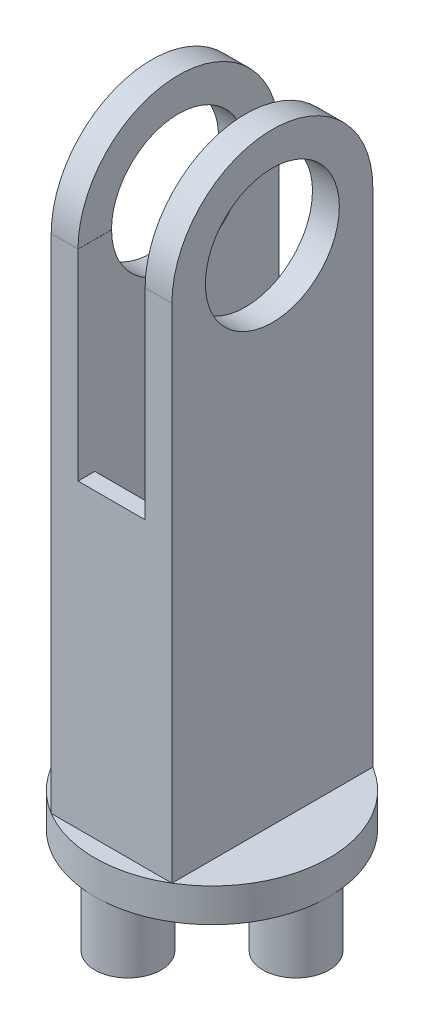
ISO-10303-21;
HEADER;
FILE_DESCRIPTION(('STEP AP214'),'2;1');
FILE_NAME('part.step','',(''),(''),'','','');
FILE_SCHEMA(('AUTOMOTIVE_DESIGN { 1 0 10303 214 1 1 1 1 }'));
ENDSEC;
DATA;
#1=APPLICATION_CONTEXT('core data for automotive mechanical design processes');
#2=APPLICATION_PROTOCOL_DEFINITION('international standard','automotive_design',2000,#1);
#3=PRODUCT_CONTEXT('',#1,'mechanical');
#4=PRODUCT('Part','Part','',(#3));
#5=PRODUCT_RELATED_PRODUCT_CATEGORY('part','',(#4));
#6=PRODUCT_DEFINITION_FORMATION('','',#4);
#7=PRODUCT_DEFINITION_CONTEXT('part definition',#1,'design');
#8=PRODUCT_DEFINITION('design','',#6,#7);
#9=PRODUCT_DEFINITION_SHAPE('','',#8);
#10=(LENGTH_UNIT() NAMED_UNIT(*) SI_UNIT(.MILLI.,.METRE.));
#11=(NAMED_UNIT(*) PLANE_ANGLE_UNIT() SI_UNIT($,.RADIAN.));
#12=(NAMED_UNIT(*) SI_UNIT($,.STERADIAN.) SOLID_ANGLE_UNIT());
#13=UNCERTAINTY_MEASURE_WITH_UNIT(LENGTH_MEASURE(1.E-05),#10,'distance_accuracy_value','');
#14=(GEOMETRIC_REPRESENTATION_CONTEXT(3) GLOBAL_UNCERTAINTY_ASSIGNED_CONTEXT((#13)) GLOBAL_UNIT_ASSIGNED_CONTEXT((#10,
#11,#12)) REPRESENTATION_CONTEXT('',''));
#15=CARTESIAN_POINT('',(0.,0.,0.));
#16=DIRECTION('',(0.,0.,1.));
#17=DIRECTION('',(1.,0.,0.));
#18=AXIS2_PLACEMENT_3D('',#15,#16,#17);
#19=CARTESIAN_POINT('',(0.,160.,0.));
#20=DIRECTION('',(0.,1.,0.));
#21=DIRECTION('',(0.,0.,1.));
#22=AXIS2_PLACEMENT_3D('',#19,#20,#21);
#23=PLANE('',#22);
#24=DIRECTION('',(1.,0.,0.));
#25=VECTOR('',#24,1.);
#26=CARTESIAN_POINT('',(-78.97224362268,160.,20.));
#27=LINE('',#26,#25);
#28=CARTESIAN_POINT('',(10.,160.,20.));
#29=VERTEX_POINT('',#28);
#30=CARTESIAN_POINT('',(10.02775637732,160.,20.));
#31=VERTEX_POINT('',#30);
#32=EDGE_CURVE('E60',#29,#31,#27,.T.);
#33=ORIENTED_EDGE('',*,*,#32,.F.);
#34=DIRECTION('',(0.,0.,-1.));
#35=VECTOR('',#34,1.);
#36=CARTESIAN_POINT('',(10.,160.,30.));
#37=LINE('',#36,#35);
#38=CARTESIAN_POINT('',(10.,160.,30.));
#39=VERTEX_POINT('',#38);
#40=EDGE_CURVE('E245',#39,#29,#37,.T.);
#41=ORIENTED_EDGE('',*,*,#40,.F.);
#42=DIRECTION('',(1.,0.,0.));
#43=VECTOR('',#42,1.);
#44=CARTESIAN_POINT('',(0.,160.,30.));
#45=LINE('',#44,#43);
#46=CARTESIAN_POINT('',(10.02775637732,160.,30.));
#47=VERTEX_POINT('',#46);
#48=EDGE_CURVE('E268',#39,#47,#45,.T.);
#49=ORIENTED_EDGE('',*,*,#48,.T.);
#50=DIRECTION('',(0.,0.,-1.));
#51=VECTOR('',#50,1.);
#52=CARTESIAN_POINT('',(10.02775637732,160.,0.));
#53=LINE('',#52,#51);
#54=EDGE_CURVE('E191',#47,#31,#53,.T.);
#55=ORIENTED_EDGE('',*,*,#54,.T.);
#56=EDGE_LOOP('',(#33,#41,#49,#55));
#57=FACE_BOUND('',#56,.T.);
#58=ADVANCED_FACE('F37',(#57),#23,.T.);
#59=DIRECTION('',(1.,0.,0.));
#60=VECTOR('',#59,1.);
#61=CARTESIAN_POINT('',(-78.97224362268,160.,20.));
#62=LINE('',#61,#60);
#63=CARTESIAN_POINT('',(-10.02775637732,160.,20.));
#64=VERTEX_POINT('',#63);
#65=CARTESIAN_POINT('',(-10.,160.,20.));
#66=VERTEX_POINT('',#65);
#67=EDGE_CURVE('E338',#64,#66,#62,.T.);
#68=ORIENTED_EDGE('',*,*,#67,.F.);
#69=DIRECTION('',(0.,0.,1.));
#70=VECTOR('',#69,1.);
#71=CARTESIAN_POINT('',(-10.02775637732,160.,0.));
#72=LINE('',#71,#70);
#73=CARTESIAN_POINT('',(-10.02775637732,160.,30.));
#74=VERTEX_POINT('',#73);
#75=EDGE_CURVE('E323',#64,#74,#72,.T.);
#76=ORIENTED_EDGE('',*,*,#75,.T.);
#77=CARTESIAN_POINT('',(-10.,160.,30.));
#78=VERTEX_POINT('',#77);
#79=EDGE_CURVE('E267',#74,#78,#45,.T.);
#80=ORIENTED_EDGE('',*,*,#79,.T.);
#81=DIRECTION('',(0.,0.,1.));
#82=VECTOR('',#81,1.);
#83=CARTESIAN_POINT('',(-10.,160.,30.));
#84=LINE('',#83,#82);
#85=EDGE_CURVE('E248',#66,#78,#84,.T.);
#86=ORIENTED_EDGE('',*,*,#85,.F.);
#87=EDGE_LOOP('',(#68,#76,#80,#86));
#88=FACE_BOUND('',#87,.T.);
#89=ADVANCED_FACE('F335',(#88),#23,.T.);
#90=DIRECTION('',(1.,0.,0.));
#91=VECTOR('',#90,1.);
#92=CARTESIAN_POINT('',(-78.97224362268,160.,-20.));
#93=LINE('',#92,#91);
#94=CARTESIAN_POINT('',(10.02775637732,160.,-20.));
#95=VERTEX_POINT('',#94);
#96=CARTESIAN_POINT('',(10.,160.,-20.));
#97=VERTEX_POINT('',#96);
#98=EDGE_CURVE('E172',#95,#97,#93,.F.);
#99=ORIENTED_EDGE('',*,*,#98,.F.);
#100=CARTESIAN_POINT('',(10.02775637732,160.,-30.));
#101=VERTEX_POINT('',#100);
#102=EDGE_CURVE('E181',#95,#101,#53,.T.);
#103=ORIENTED_EDGE('',*,*,#102,.T.);
#104=DIRECTION('',(1.,0.,0.));
#105=VECTOR('',#104,1.);
#106=CARTESIAN_POINT('',(0.,160.,-30.));
#107=LINE('',#106,#105);
#108=CARTESIAN_POINT('',(10.,160.,-30.));
#109=VERTEX_POINT('',#108);
#110=EDGE_CURVE('E274',#109,#101,#107,.T.);
#111=ORIENTED_EDGE('',*,*,#110,.F.);
#112=EDGE_CURVE('E183',#97,#109,#37,.T.);
#113=ORIENTED_EDGE('',*,*,#112,.F.);
#114=EDGE_LOOP('',(#99,#103,#111,#113));
#115=FACE_BOUND('',#114,.T.);
#116=ADVANCED_FACE('F179',(#115),#23,.T.);
#117=DIRECTION('',(1.,0.,0.));
#118=VECTOR('',#117,1.);
#119=CARTESIAN_POINT('',(-78.97224362268,160.,-20.));
#120=LINE('',#119,#118);
#121=CARTESIAN_POINT('',(-10.,160.,-20.));
#122=VERTEX_POINT('',#121);
#123=CARTESIAN_POINT('',(-10.02775637732,160.,-20.));
#124=VERTEX_POINT('',#123);
#125=EDGE_CURVE('E52',#122,#124,#120,.F.);
#126=ORIENTED_EDGE('',*,*,#125,.F.);
#127=CARTESIAN_POINT('',(-10.,160.,-30.));
#128=VERTEX_POINT('',#127);
#129=EDGE_CURVE('E249',#128,#122,#84,.T.);
#130=ORIENTED_EDGE('',*,*,#129,.F.);
#131=CARTESIAN_POINT('',(-10.02775637732,160.,-30.));
#132=VERTEX_POINT('',#131);
#133=EDGE_CURVE('E273',#132,#128,#107,.T.);
#134=ORIENTED_EDGE('',*,*,#133,.F.);
#135=EDGE_CURVE('E45',#132,#124,#72,.T.);
#136=ORIENTED_EDGE('',*,*,#135,.T.);
#137=EDGE_LOOP('',(#126,#130,#134,#136));
#138=FACE_BOUND('',#137,.T.);
#139=ADVANCED_FACE('F399',(#138),#23,.T.);
#140=CARTESIAN_POINT('',(0.,100.,0.));
#141=DIRECTION('',(0.,-1.,0.));
#142=DIRECTION('',(0.,0.,-1.));
#143=AXIS2_PLACEMENT_3D('',#140,#141,#142);
#144=PLANE('',#143);
#145=DIRECTION('',(0.,0.,-1.));
#146=VECTOR('',#145,1.);
#147=CARTESIAN_POINT('',(10.,100.,30.));
#148=LINE('',#147,#146);
#149=CARTESIAN_POINT('',(10.,100.,30.));
#150=VERTEX_POINT('',#149);
#151=CARTESIAN_POINT('',(10.,100.,25.));
#152=VERTEX_POINT('',#151);
#153=EDGE_CURVE('E230',#150,#152,#148,.T.);
#154=ORIENTED_EDGE('',*,*,#153,.T.);
#155=DIRECTION('',(1.,0.,0.));
#156=VECTOR('',#155,1.);
#157=CARTESIAN_POINT('',(-10.,100.,25.));
#158=LINE('',#157,#156);
#159=CARTESIAN_POINT('',(-10.,100.,25.));
#160=VERTEX_POINT('',#159);
#161=EDGE_CURVE('E209',#160,#152,#158,.T.);
#162=ORIENTED_EDGE('',*,*,#161,.F.);
#163=DIRECTION('',(0.,0.,1.));
#164=VECTOR('',#163,1.);
#165=CARTESIAN_POINT('',(-10.,100.,30.));
#166=LINE('',#165,#164);
#167=CARTESIAN_POINT('',(-10.,100.,30.));
#168=VERTEX_POINT('',#167);
#169=EDGE_CURVE('E237',#160,#168,#166,.T.);
#170=ORIENTED_EDGE('',*,*,#169,.T.);
#171=DIRECTION('',(1.,0.,0.));
#172=VECTOR('',#171,1.);
#173=CARTESIAN_POINT('',(-10.,100.,30.));
#174=LINE('',#173,#172);
#175=EDGE_CURVE('E241',#168,#150,#174,.T.);
#176=ORIENTED_EDGE('',*,*,#175,.T.);
#177=EDGE_LOOP('',(#154,#162,#170,#176));
#178=FACE_BOUND('',#177,.T.);
#179=ADVANCED_FACE('F406',(#178),#144,.F.);
#180=CARTESIAN_POINT('',(0.,10.,0.));
#181=DIRECTION('',(0.,1.,0.));
#182=DIRECTION('',(0.,0.,1.));
#183=AXIS2_PLACEMENT_3D('',#180,#181,#182);
#184=PLANE('',#183);
#185=CARTESIAN_POINT('',(0.,10.,0.));
#186=DIRECTION('',(0.,1.,0.));
#187=DIRECTION('',(0.,0.,1.));
#188=AXIS2_PLACEMENT_3D('',#185,#186,#187);
#189=CIRCLE('',#188,35.);
#190=CARTESIAN_POINT('',(-18.02775637732,10.,-30.));
#191=VERTEX_POINT('',#190);
#192=CARTESIAN_POINT('',(-18.02775637732,10.,30.));
#193=VERTEX_POINT('',#192);
#194=EDGE_CURVE('E467',#191,#193,#189,.T.);
#195=ORIENTED_EDGE('',*,*,#194,.T.);
#196=DIRECTION('',(0.,0.,-1.));
#197=VECTOR('',#196,1.);
#198=CARTESIAN_POINT('',(-18.02775637732,10.,0.));
#199=LINE('',#198,#197);
#200=EDGE_CURVE('E283',#193,#191,#199,.T.);
#201=ORIENTED_EDGE('',*,*,#200,.T.);
#202=EDGE_LOOP('',(#195,#201));
#203=FACE_BOUND('',#202,.T.);
#204=ADVANCED_FACE('F411',(#203),#184,.T.);
#205=CARTESIAN_POINT('',(18.02775637732,10.,-30.));
#206=VERTEX_POINT('',#205);
#207=EDGE_CURVE('E324',#206,#191,#189,.T.);
#208=ORIENTED_EDGE('',*,*,#207,.T.);
#209=DIRECTION('',(1.,0.,0.));
#210=VECTOR('',#209,1.);
#211=CARTESIAN_POINT('',(0.,10.,-30.));
#212=LINE('',#211,#210);
#213=EDGE_CURVE('E280',#191,#206,#212,.T.);
#214=ORIENTED_EDGE('',*,*,#213,.T.);
#215=EDGE_LOOP('',(#208,#214));
#216=FACE_BOUND('',#215,.T.);
#217=ADVANCED_FACE('F471',(#216),#184,.T.);
#218=DIRECTION('',(1.,0.,0.));
#219=VECTOR('',#218,1.);
#220=CARTESIAN_POINT('',(0.,10.,30.));
#221=LINE('',#220,#219);
#222=CARTESIAN_POINT('',(18.02775637732,10.,30.));
#223=VERTEX_POINT('',#222);
#224=EDGE_CURVE('E254',#193,#223,#221,.T.);
#225=ORIENTED_EDGE('',*,*,#224,.F.);
#226=EDGE_CURVE('E325',#193,#223,#189,.T.);
#227=ORIENTED_EDGE('',*,*,#226,.T.);
#228=EDGE_LOOP('',(#225,#227));
#229=FACE_BOUND('',#228,.T.);
#230=ADVANCED_FACE('F460',(#229),#184,.T.);
#231=CARTESIAN_POINT('',(0.,10.,0.));
#232=DIRECTION('',(0.,-1.,0.));
#233=DIRECTION('',(0.,0.,-1.));
#234=AXIS2_PLACEMENT_3D('',#231,#232,#233);
#235=CYLINDRICAL_SURFACE('',#234,35.);
#236=EDGE_CURVE('E321',#223,#206,#189,.T.);
#237=ORIENTED_EDGE('',*,*,#236,.F.);
#238=ORIENTED_EDGE('',*,*,#226,.F.);
#239=ORIENTED_EDGE('',*,*,#194,.F.);
#240=ORIENTED_EDGE('',*,*,#207,.F.);
#241=EDGE_LOOP('',(#237,#238,#239,#240));
#242=FACE_BOUND('',#241,.T.);
#243=CARTESIAN_POINT('',(0.,0.,0.));
#244=DIRECTION('',(0.,1.,0.));
#245=DIRECTION('',(0.,0.,1.));
#246=AXIS2_PLACEMENT_3D('',#243,#244,#245);
#247=CIRCLE('',#246,35.);
#248=CARTESIAN_POINT('',(35.,0.,0.));
#249=VERTEX_POINT('',#248);
#250=CARTESIAN_POINT('',(0.,0.,-35.));
#251=VERTEX_POINT('',#250);
#252=EDGE_CURVE('E326',#249,#251,#247,.T.);
#253=ORIENTED_EDGE('',*,*,#252,.T.);
#254=CARTESIAN_POINT('',(-35.,0.,0.));
#255=VERTEX_POINT('',#254);
#256=EDGE_CURVE('E327',#251,#255,#247,.T.);
#257=ORIENTED_EDGE('',*,*,#256,.T.);
#258=CARTESIAN_POINT('',(0.,0.,35.));
#259=VERTEX_POINT('',#258);
#260=EDGE_CURVE('E497',#255,#259,#247,.T.);
#261=ORIENTED_EDGE('',*,*,#260,.T.);
#262=EDGE_CURVE('E318',#259,#249,#247,.T.);
#263=ORIENTED_EDGE('',*,*,#262,.T.);
#264=EDGE_LOOP('',(#253,#257,#261,#263));
#265=FACE_BOUND('',#264,.T.);
#266=ADVANCED_FACE('F39',(#242,#265),#235,.T.);
#267=DIRECTION('',(0.,0.,-1.));
#268=VECTOR('',#267,1.);
#269=CARTESIAN_POINT('',(18.02775637732,10.,0.));
#270=LINE('',#269,#268);
#271=EDGE_CURVE('E277',#223,#206,#270,.T.);
#272=ORIENTED_EDGE('',*,*,#271,.F.);
#273=ORIENTED_EDGE('',*,*,#236,.T.);
#274=EDGE_LOOP('',(#272,#273));
#275=FACE_BOUND('',#274,.T.);
#276=ADVANCED_FACE('F478',(#275),#184,.T.);
#277=CARTESIAN_POINT('',(0.,0.,0.));
#278=DIRECTION('',(0.,1.,0.));
#279=DIRECTION('',(0.,0.,1.));
#280=AXIS2_PLACEMENT_3D('',#277,#278,#279);
#281=PLANE('',#280);
#282=ORIENTED_EDGE('',*,*,#262,.F.);
#283=CARTESIAN_POINT('',(0.,0.,25.1));
#284=DIRECTION('',(0.,-1.,0.));
#285=DIRECTION('',(0.,0.,-1.));
#286=AXIS2_PLACEMENT_3D('',#283,#284,#285);
#287=CIRCLE('',#286,9.9);
#288=EDGE_CURVE('E297',#259,#259,#287,.T.);
#289=ORIENTED_EDGE('',*,*,#288,.F.);
#290=ORIENTED_EDGE('',*,*,#260,.F.);
#291=CARTESIAN_POINT('',(-25.1,0.,0.));
#292=DIRECTION('',(0.,-1.,0.));
#293=DIRECTION('',(0.,0.,-1.));
#294=AXIS2_PLACEMENT_3D('',#291,#292,#293);
#295=CIRCLE('',#294,9.9);
#296=EDGE_CURVE('E303',#255,#255,#295,.T.);
#297=ORIENTED_EDGE('',*,*,#296,.F.);
#298=ORIENTED_EDGE('',*,*,#256,.F.);
#299=CARTESIAN_POINT('',(0.,0.,-25.1));
#300=DIRECTION('',(0.,-1.,0.));
#301=DIRECTION('',(0.,0.,-1.));
#302=AXIS2_PLACEMENT_3D('',#299,#300,#301);
#303=CIRCLE('',#302,9.9);
#304=EDGE_CURVE('E309',#251,#251,#303,.T.);
#305=ORIENTED_EDGE('',*,*,#304,.F.);
#306=ORIENTED_EDGE('',*,*,#252,.F.);
#307=CARTESIAN_POINT('',(25.1,0.,0.));
#308=DIRECTION('',(0.,-1.,0.));
#309=DIRECTION('',(0.,0.,-1.));
#310=AXIS2_PLACEMENT_3D('',#307,#308,#309);
#311=CIRCLE('',#310,9.9);
#312=EDGE_CURVE('E312',#249,#249,#311,.T.);
#313=ORIENTED_EDGE('',*,*,#312,.F.);
#314=EDGE_LOOP('',(#282,#289,#290,#297,#298,#305,#306,#313));
#315=FACE_BOUND('',#314,.T.);
#316=ADVANCED_FACE('F481',(#315),#281,.F.);
#317=CARTESIAN_POINT('',(25.1,-19.,0.));
#318=DIRECTION('',(0.,1.,0.));
#319=DIRECTION('',(0.,0.,1.));
#320=AXIS2_PLACEMENT_3D('',#317,#318,#319);
#321=CYLINDRICAL_SURFACE('',#320,9.9);
#322=CARTESIAN_POINT('',(25.1,-19.,0.));
#323=DIRECTION('',(0.,-1.,0.));
#324=DIRECTION('',(0.,0.,-1.));
#325=AXIS2_PLACEMENT_3D('',#322,#323,#324);
#326=CIRCLE('',#325,9.9);
#327=CARTESIAN_POINT('',(25.1,-19.,-9.9));
#328=VERTEX_POINT('',#327);
#329=EDGE_CURVE('E315',#328,#328,#326,.T.);
#330=ORIENTED_EDGE('',*,*,#329,.F.);
#331=EDGE_LOOP('',(#330));
#332=FACE_BOUND('',#331,.T.);
#333=ORIENTED_EDGE('',*,*,#312,.T.);
#334=EDGE_LOOP('',(#333));
#335=FACE_BOUND('',#334,.T.);
#336=ADVANCED_FACE('F483',(#332,#335),#321,.T.);
#337=CARTESIAN_POINT('',(25.1,-19.,0.));
#338=DIRECTION('',(0.,-1.,0.));
#339=DIRECTION('',(0.,0.,-1.));
#340=AXIS2_PLACEMENT_3D('',#337,#338,#339);
#341=PLANE('',#340);
#342=ORIENTED_EDGE('',*,*,#329,.T.);
#343=EDGE_LOOP('',(#342));
#344=FACE_BOUND('',#343,.T.);
#345=ADVANCED_FACE('F490',(#344),#341,.T.);
#346=CARTESIAN_POINT('',(0.,-19.,-25.1));
#347=DIRECTION('',(0.,1.,0.));
#348=DIRECTION('',(0.,0.,1.));
#349=AXIS2_PLACEMENT_3D('',#346,#347,#348);
#350=CYLINDRICAL_SURFACE('',#349,9.9);
#351=CARTESIAN_POINT('',(0.,-19.,-25.1));
#352=DIRECTION('',(0.,-1.,0.));
#353=DIRECTION('',(0.,0.,-1.));
#354=AXIS2_PLACEMENT_3D('',#351,#352,#353);
#355=CIRCLE('',#354,9.9);
#356=CARTESIAN_POINT('',(0.,-19.,-35.));
#357=VERTEX_POINT('',#356);
#358=EDGE_CURVE('E306',#357,#357,#355,.T.);
#359=ORIENTED_EDGE('',*,*,#358,.F.);
#360=EDGE_LOOP('',(#359));
#361=FACE_BOUND('',#360,.T.);
#362=ORIENTED_EDGE('',*,*,#304,.T.);
#363=EDGE_LOOP('',(#362));
#364=FACE_BOUND('',#363,.T.);
#365=ADVANCED_FACE('F515',(#361,#364),#350,.T.);
#366=CARTESIAN_POINT('',(0.,-19.,-25.1));
#367=DIRECTION('',(0.,-1.,0.));
#368=DIRECTION('',(0.,0.,-1.));
#369=AXIS2_PLACEMENT_3D('',#366,#367,#368);
#370=PLANE('',#369);
#371=ORIENTED_EDGE('',*,*,#358,.T.);
#372=EDGE_LOOP('',(#371));
#373=FACE_BOUND('',#372,.T.);
#374=ADVANCED_FACE('F505',(#373),#370,.T.);
#375=CARTESIAN_POINT('',(-25.1,-19.,0.));
#376=DIRECTION('',(0.,1.,0.));
#377=DIRECTION('',(0.,0.,1.));
#378=AXIS2_PLACEMENT_3D('',#375,#376,#377);
#379=CYLINDRICAL_SURFACE('',#378,9.9);
#380=CARTESIAN_POINT('',(-25.1,-19.,0.));
#381=DIRECTION('',(0.,-1.,0.));
#382=DIRECTION('',(0.,0.,-1.));
#383=AXIS2_PLACEMENT_3D('',#380,#381,#382);
#384=CIRCLE('',#383,9.9);
#385=CARTESIAN_POINT('',(-25.1,-19.,-9.9));
#386=VERTEX_POINT('',#385);
#387=EDGE_CURVE('E300',#386,#386,#384,.T.);
#388=ORIENTED_EDGE('',*,*,#387,.F.);
#389=EDGE_LOOP('',(#388));
#390=FACE_BOUND('',#389,.T.);
#391=ORIENTED_EDGE('',*,*,#296,.T.);
#392=EDGE_LOOP('',(#391));
#393=FACE_BOUND('',#392,.T.);
#394=ADVANCED_FACE('F502',(#390,#393),#379,.T.);
#395=CARTESIAN_POINT('',(-25.1,-19.,0.));
#396=DIRECTION('',(0.,-1.,0.));
#397=DIRECTION('',(0.,0.,-1.));
#398=AXIS2_PLACEMENT_3D('',#395,#396,#397);
#399=PLANE('',#398);
#400=ORIENTED_EDGE('',*,*,#387,.T.);
#401=EDGE_LOOP('',(#400));
#402=FACE_BOUND('',#401,.T.);
#403=ADVANCED_FACE('F504',(#402),#399,.T.);
#404=CARTESIAN_POINT('',(0.,-19.,25.1));
#405=DIRECTION('',(0.,1.,0.));
#406=DIRECTION('',(0.,0.,1.));
#407=AXIS2_PLACEMENT_3D('',#404,#405,#406);
#408=CYLINDRICAL_SURFACE('',#407,9.9);
#409=CARTESIAN_POINT('',(0.,-19.,25.1));
#410=DIRECTION('',(0.,-1.,0.));
#411=DIRECTION('',(0.,0.,-1.));
#412=AXIS2_PLACEMENT_3D('',#409,#410,#411);
#413=CIRCLE('',#412,9.9);
#414=CARTESIAN_POINT('',(0.,-19.,15.2));
#415=VERTEX_POINT('',#414);
#416=EDGE_CURVE('E296',#415,#415,#413,.T.);
#417=ORIENTED_EDGE('',*,*,#416,.F.);
#418=EDGE_LOOP('',(#417));
#419=FACE_BOUND('',#418,.T.);
#420=ORIENTED_EDGE('',*,*,#288,.T.);
#421=EDGE_LOOP('',(#420));
#422=FACE_BOUND('',#421,.T.);
#423=ADVANCED_FACE('F512',(#419,#422),#408,.T.);
#424=CARTESIAN_POINT('',(0.,-19.,25.1));
#425=DIRECTION('',(0.,-1.,0.));
#426=DIRECTION('',(0.,0.,-1.));
#427=AXIS2_PLACEMENT_3D('',#424,#425,#426);
#428=PLANE('',#427);
#429=ORIENTED_EDGE('',*,*,#416,.T.);
#430=EDGE_LOOP('',(#429));
#431=FACE_BOUND('',#430,.T.);
#432=ADVANCED_FACE('F395',(#431),#428,.T.);
#433=CARTESIAN_POINT('',(0.,160.,30.));
#434=DIRECTION('',(0.,0.,-1.));
#435=DIRECTION('',(-1.,0.,0.));
#436=AXIS2_PLACEMENT_3D('',#433,#434,#435);
#437=PLANE('',#436);
#438=ORIENTED_EDGE('',*,*,#48,.F.);
#439=DIRECTION('',(0.,1.,0.));
#440=VECTOR('',#439,1.);
#441=CARTESIAN_POINT('',(10.,100.,30.));
#442=LINE('',#441,#440);
#443=EDGE_CURVE('E252',#150,#39,#442,.T.);
#444=ORIENTED_EDGE('',*,*,#443,.F.);
#445=ORIENTED_EDGE('',*,*,#175,.F.);
#446=DIRECTION('',(0.,1.,0.));
#447=VECTOR('',#446,1.);
#448=CARTESIAN_POINT('',(-10.,100.,30.));
#449=LINE('',#448,#447);
#450=EDGE_CURVE('E255',#168,#78,#449,.T.);
#451=ORIENTED_EDGE('',*,*,#450,.T.);
#452=ORIENTED_EDGE('',*,*,#79,.F.);
#453=CARTESIAN_POINT('',(-18.02775637732,160.,30.));
#454=VERTEX_POINT('',#453);
#455=EDGE_CURVE('E263',#454,#74,#45,.T.);
#456=ORIENTED_EDGE('',*,*,#455,.F.);
#457=DIRECTION('',(0.,-1.,0.));
#458=VECTOR('',#457,1.);
#459=CARTESIAN_POINT('',(-18.02775637732,160.,30.));
#460=LINE('',#459,#458);
#461=EDGE_CURVE('E272',#454,#193,#460,.T.);
#462=ORIENTED_EDGE('',*,*,#461,.T.);
#463=ORIENTED_EDGE('',*,*,#224,.T.);
#464=DIRECTION('',(0.,-1.,0.));
#465=VECTOR('',#464,1.);
#466=CARTESIAN_POINT('',(18.02775637732,160.,30.));
#467=LINE('',#466,#465);
#468=CARTESIAN_POINT('',(18.02775637732,160.,30.));
#469=VERTEX_POINT('',#468);
#470=EDGE_CURVE('E293',#469,#223,#467,.T.);
#471=ORIENTED_EDGE('',*,*,#470,.F.);
#472=DIRECTION('',(1.,0.,0.));
#473=VECTOR('',#472,1.);
#474=CARTESIAN_POINT('',(10.02775637732,160.,30.));
#475=LINE('',#474,#473);
#476=EDGE_CURVE('E193',#47,#469,#475,.T.);
#477=ORIENTED_EDGE('',*,*,#476,.F.);
#478=EDGE_LOOP('',(#438,#444,#445,#451,#452,#456,#462,#463,#471,#477));
#479=FACE_BOUND('',#478,.T.);
#480=ADVANCED_FACE('F349',(#479),#437,.F.);
#481=CARTESIAN_POINT('',(18.02775637732,160.,0.));
#482=DIRECTION('',(-1.,0.,0.));
#483=DIRECTION('',(0.,0.,1.));
#484=AXIS2_PLACEMENT_3D('',#481,#482,#483);
#485=PLANE('',#484);
#486=CARTESIAN_POINT('',(18.02775637732,160.,0.));
#487=DIRECTION('',(1.,0.,0.));
#488=DIRECTION('',(0.,0.,-1.));
#489=AXIS2_PLACEMENT_3D('',#486,#487,#488);
#490=CIRCLE('',#489,20.);
#491=CARTESIAN_POINT('',(18.02775637732,160.,-20.));
#492=VERTEX_POINT('',#491);
#493=EDGE_CURVE('E184',#492,#492,#490,.T.);
#494=ORIENTED_EDGE('',*,*,#493,.F.);
#495=EDGE_LOOP('',(#494));
#496=FACE_BOUND('',#495,.T.);
#497=DIRECTION('',(0.,-1.,0.));
#498=VECTOR('',#497,1.);
#499=CARTESIAN_POINT('',(18.02775637732,160.,-30.));
#500=LINE('',#499,#498);
#501=CARTESIAN_POINT('',(18.02775637732,160.,-30.));
#502=VERTEX_POINT('',#501);
#503=EDGE_CURVE('E290',#502,#206,#500,.T.);
#504=ORIENTED_EDGE('',*,*,#503,.F.);
#505=CARTESIAN_POINT('',(18.02775637732,160.,0.));
#506=DIRECTION('',(1.,0.,0.));
#507=DIRECTION('',(0.,0.,-1.));
#508=AXIS2_PLACEMENT_3D('',#505,#506,#507);
#509=CIRCLE('',#508,30.);
#510=EDGE_CURVE('E194',#502,#469,#509,.T.);
#511=ORIENTED_EDGE('',*,*,#510,.T.);
#512=ORIENTED_EDGE('',*,*,#470,.T.);
#513=ORIENTED_EDGE('',*,*,#271,.T.);
#514=EDGE_LOOP('',(#504,#511,#512,#513));
#515=FACE_BOUND('',#514,.T.);
#516=ADVANCED_FACE('F364',(#496,#515),#485,.F.);
#517=CARTESIAN_POINT('',(0.,160.,-30.));
#518=DIRECTION('',(0.,0.,-1.));
#519=DIRECTION('',(-1.,0.,0.));
#520=AXIS2_PLACEMENT_3D('',#517,#518,#519);
#521=PLANE('',#520);
#522=DIRECTION('',(0.,1.,0.));
#523=VECTOR('',#522,1.);
#524=CARTESIAN_POINT('',(10.,100.,-30.));
#525=LINE('',#524,#523);
#526=CARTESIAN_POINT('',(10.,100.,-30.));
#527=VERTEX_POINT('',#526);
#528=EDGE_CURVE('E244',#527,#109,#525,.T.);
#529=ORIENTED_EDGE('',*,*,#528,.T.);
#530=ORIENTED_EDGE('',*,*,#110,.T.);
#531=EDGE_CURVE('E266',#101,#502,#107,.T.);
#532=ORIENTED_EDGE('',*,*,#531,.T.);
#533=ORIENTED_EDGE('',*,*,#503,.T.);
#534=ORIENTED_EDGE('',*,*,#213,.F.);
#535=DIRECTION('',(0.,-1.,0.));
#536=VECTOR('',#535,1.);
#537=CARTESIAN_POINT('',(-18.02775637732,160.,-30.));
#538=LINE('',#537,#536);
#539=CARTESIAN_POINT('',(-18.02775637732,160.,-30.));
#540=VERTEX_POINT('',#539);
#541=EDGE_CURVE('E287',#540,#191,#538,.T.);
#542=ORIENTED_EDGE('',*,*,#541,.F.);
#543=EDGE_CURVE('E269',#540,#132,#107,.T.);
#544=ORIENTED_EDGE('',*,*,#543,.T.);
#545=ORIENTED_EDGE('',*,*,#133,.T.);
#546=DIRECTION('',(0.,1.,0.));
#547=VECTOR('',#546,1.);
#548=CARTESIAN_POINT('',(-10.,100.,-30.));
#549=LINE('',#548,#547);
#550=CARTESIAN_POINT('',(-10.,100.,-30.));
#551=VERTEX_POINT('',#550);
#552=EDGE_CURVE('E258',#551,#128,#549,.T.);
#553=ORIENTED_EDGE('',*,*,#552,.F.);
#554=DIRECTION('',(-1.,0.,0.));
#555=VECTOR('',#554,1.);
#556=CARTESIAN_POINT('',(-10.,100.,-30.));
#557=LINE('',#556,#555);
#558=EDGE_CURVE('E233',#527,#551,#557,.T.);
#559=ORIENTED_EDGE('',*,*,#558,.F.);
#560=EDGE_LOOP('',(#529,#530,#532,#533,#534,#542,#544,#545,#553,#559));
#561=FACE_BOUND('',#560,.T.);
#562=ADVANCED_FACE('F386',(#561),#521,.T.);
#563=CARTESIAN_POINT('',(-18.02775637732,160.,0.));
#564=DIRECTION('',(-1.,0.,0.));
#565=DIRECTION('',(0.,0.,1.));
#566=AXIS2_PLACEMENT_3D('',#563,#564,#565);
#567=PLANE('',#566);
#568=CARTESIAN_POINT('',(-18.02775637732,160.,0.));
#569=DIRECTION('',(-1.,0.,0.));
#570=DIRECTION('',(0.,0.,1.));
#571=AXIS2_PLACEMENT_3D('',#568,#569,#570);
#572=CIRCLE('',#571,20.);
#573=CARTESIAN_POINT('',(-18.02775637732,160.,20.));
#574=VERTEX_POINT('',#573);
#575=EDGE_CURVE('E365',#574,#574,#572,.T.);
#576=ORIENTED_EDGE('',*,*,#575,.F.);
#577=EDGE_LOOP('',(#576));
#578=FACE_BOUND('',#577,.T.);
#579=ORIENTED_EDGE('',*,*,#461,.F.);
#580=CARTESIAN_POINT('',(-18.02775637732,160.,0.));
#581=DIRECTION('',(-1.,0.,0.));
#582=DIRECTION('',(0.,0.,1.));
#583=AXIS2_PLACEMENT_3D('',#580,#581,#582);
#584=CIRCLE('',#583,30.);
#585=EDGE_CURVE('E199',#454,#540,#584,.T.);
#586=ORIENTED_EDGE('',*,*,#585,.T.);
#587=ORIENTED_EDGE('',*,*,#541,.T.);
#588=ORIENTED_EDGE('',*,*,#200,.F.);
#589=EDGE_LOOP('',(#579,#586,#587,#588));
#590=FACE_BOUND('',#589,.T.);
#591=ADVANCED_FACE('F392',(#578,#590),#567,.T.);
#592=CARTESIAN_POINT('',(10.,100.,30.));
#593=DIRECTION('',(1.,0.,0.));
#594=DIRECTION('',(0.,0.,-1.));
#595=AXIS2_PLACEMENT_3D('',#592,#593,#594);
#596=PLANE('',#595);
#597=ORIENTED_EDGE('',*,*,#40,.T.);
#598=CARTESIAN_POINT('',(9.99999999999999,160.,0.));
#599=DIRECTION('',(1.,0.,0.));
#600=DIRECTION('',(0.,0.,-1.));
#601=AXIS2_PLACEMENT_3D('',#598,#599,#600);
#602=CIRCLE('',#601,20.);
#603=EDGE_CURVE('E378',#29,#97,#602,.T.);
#604=ORIENTED_EDGE('',*,*,#603,.T.);
#605=ORIENTED_EDGE('',*,*,#112,.T.);
#606=ORIENTED_EDGE('',*,*,#528,.F.);
#607=CARTESIAN_POINT('',(10.,100.,-25.));
#608=VERTEX_POINT('',#607);
#609=EDGE_CURVE('E234',#608,#527,#148,.T.);
#610=ORIENTED_EDGE('',*,*,#609,.F.);
#611=DIRECTION('',(0.,1.,0.));
#612=VECTOR('',#611,1.);
#613=CARTESIAN_POINT('',(10.,9.99999999999998,-25.));
#614=LINE('',#613,#612);
#615=CARTESIAN_POINT('',(10.,9.99999999999998,-25.));
#616=VERTEX_POINT('',#615);
#617=EDGE_CURVE('E218',#616,#608,#614,.T.);
#618=ORIENTED_EDGE('',*,*,#617,.F.);
#619=DIRECTION('',(0.,0.,-1.));
#620=VECTOR('',#619,1.);
#621=CARTESIAN_POINT('',(10.,9.99999999999998,25.));
#622=LINE('',#621,#620);
#623=CARTESIAN_POINT('',(10.,9.99999999999998,25.));
#624=VERTEX_POINT('',#623);
#625=EDGE_CURVE('E205',#624,#616,#622,.T.);
#626=ORIENTED_EDGE('',*,*,#625,.F.);
#627=DIRECTION('',(0.,1.,0.));
#628=VECTOR('',#627,1.);
#629=CARTESIAN_POINT('',(10.,9.99999999999998,25.));
#630=LINE('',#629,#628);
#631=EDGE_CURVE('E223',#624,#152,#630,.T.);
#632=ORIENTED_EDGE('',*,*,#631,.T.);
#633=ORIENTED_EDGE('',*,*,#153,.F.);
#634=ORIENTED_EDGE('',*,*,#443,.T.);
#635=EDGE_LOOP('',(#597,#604,#605,#606,#610,#618,#626,#632,#633,#634));
#636=FACE_BOUND('',#635,.T.);
#637=ADVANCED_FACE('F425',(#636),#596,.F.);
#638=CARTESIAN_POINT('',(-10.,100.,30.));
#639=DIRECTION('',(-1.,0.,0.));
#640=DIRECTION('',(0.,0.,1.));
#641=AXIS2_PLACEMENT_3D('',#638,#639,#640);
#642=PLANE('',#641);
#643=ORIENTED_EDGE('',*,*,#129,.T.);
#644=CARTESIAN_POINT('',(-9.99999999999999,160.,0.));
#645=DIRECTION('',(-1.,0.,0.));
#646=DIRECTION('',(0.,0.,1.));
#647=AXIS2_PLACEMENT_3D('',#644,#645,#646);
#648=CIRCLE('',#647,20.);
#649=EDGE_CURVE('E367',#122,#66,#648,.T.);
#650=ORIENTED_EDGE('',*,*,#649,.T.);
#651=ORIENTED_EDGE('',*,*,#85,.T.);
#652=ORIENTED_EDGE('',*,*,#450,.F.);
#653=ORIENTED_EDGE('',*,*,#169,.F.);
#654=DIRECTION('',(0.,1.,0.));
#655=VECTOR('',#654,1.);
#656=CARTESIAN_POINT('',(-10.,9.99999999999998,25.));
#657=LINE('',#656,#655);
#658=CARTESIAN_POINT('',(-10.,9.99999999999998,25.));
#659=VERTEX_POINT('',#658);
#660=EDGE_CURVE('E225',#659,#160,#657,.T.);
#661=ORIENTED_EDGE('',*,*,#660,.F.);
#662=DIRECTION('',(0.,0.,1.));
#663=VECTOR('',#662,1.);
#664=CARTESIAN_POINT('',(-10.,9.99999999999998,25.));
#665=LINE('',#664,#663);
#666=CARTESIAN_POINT('',(-10.,9.99999999999998,-25.));
#667=VERTEX_POINT('',#666);
#668=EDGE_CURVE('E212',#667,#659,#665,.T.);
#669=ORIENTED_EDGE('',*,*,#668,.F.);
#670=DIRECTION('',(0.,1.,0.));
#671=VECTOR('',#670,1.);
#672=CARTESIAN_POINT('',(-10.,9.99999999999998,-25.));
#673=LINE('',#672,#671);
#674=CARTESIAN_POINT('',(-10.,100.,-25.));
#675=VERTEX_POINT('',#674);
#676=EDGE_CURVE('E227',#667,#675,#673,.T.);
#677=ORIENTED_EDGE('',*,*,#676,.T.);
#678=EDGE_CURVE('E238',#551,#675,#166,.T.);
#679=ORIENTED_EDGE('',*,*,#678,.F.);
#680=ORIENTED_EDGE('',*,*,#552,.T.);
#681=EDGE_LOOP('',(#643,#650,#651,#652,#653,#661,#669,#677,#679,#680));
#682=FACE_BOUND('',#681,.T.);
#683=ADVANCED_FACE('F417',(#682),#642,.F.);
#684=ORIENTED_EDGE('',*,*,#678,.T.);
#685=DIRECTION('',(-1.,0.,0.));
#686=VECTOR('',#685,1.);
#687=CARTESIAN_POINT('',(-10.,100.,-25.));
#688=LINE('',#687,#686);
#689=EDGE_CURVE('E203',#608,#675,#688,.T.);
#690=ORIENTED_EDGE('',*,*,#689,.F.);
#691=ORIENTED_EDGE('',*,*,#609,.T.);
#692=ORIENTED_EDGE('',*,*,#558,.T.);
#693=EDGE_LOOP('',(#684,#690,#691,#692));
#694=FACE_BOUND('',#693,.T.);
#695=ADVANCED_FACE('F414',(#694),#144,.F.);
#696=CARTESIAN_POINT('',(-10.,9.99999999999998,25.));
#697=DIRECTION('',(0.,0.,1.));
#698=DIRECTION('',(1.,0.,0.));
#699=AXIS2_PLACEMENT_3D('',#696,#697,#698);
#700=PLANE('',#699);
#701=ORIENTED_EDGE('',*,*,#161,.T.);
#702=ORIENTED_EDGE('',*,*,#631,.F.);
#703=DIRECTION('',(1.,0.,0.));
#704=VECTOR('',#703,1.);
#705=CARTESIAN_POINT('',(-10.,9.99999999999998,25.));
#706=LINE('',#705,#704);
#707=EDGE_CURVE('E215',#659,#624,#706,.T.);
#708=ORIENTED_EDGE('',*,*,#707,.F.);
#709=ORIENTED_EDGE('',*,*,#660,.T.);
#710=EDGE_LOOP('',(#701,#702,#708,#709));
#711=FACE_BOUND('',#710,.T.);
#712=ADVANCED_FACE('F435',(#711),#700,.F.);
#713=CARTESIAN_POINT('',(-10.,9.99999999999998,-25.));
#714=DIRECTION('',(0.,0.,-1.));
#715=DIRECTION('',(-1.,0.,0.));
#716=AXIS2_PLACEMENT_3D('',#713,#714,#715);
#717=PLANE('',#716);
#718=ORIENTED_EDGE('',*,*,#689,.T.);
#719=ORIENTED_EDGE('',*,*,#676,.F.);
#720=DIRECTION('',(-1.,0.,0.));
#721=VECTOR('',#720,1.);
#722=CARTESIAN_POINT('',(-10.,9.99999999999998,-25.));
#723=LINE('',#722,#721);
#724=EDGE_CURVE('E208',#616,#667,#723,.T.);
#725=ORIENTED_EDGE('',*,*,#724,.F.);
#726=ORIENTED_EDGE('',*,*,#617,.T.);
#727=EDGE_LOOP('',(#718,#719,#725,#726));
#728=FACE_BOUND('',#727,.T.);
#729=ADVANCED_FACE('F438',(#728),#717,.F.);
#730=CARTESIAN_POINT('',(0.,9.99999999999998,0.));
#731=DIRECTION('',(0.,-1.,0.));
#732=DIRECTION('',(0.,0.,-1.));
#733=AXIS2_PLACEMENT_3D('',#730,#731,#732);
#734=PLANE('',#733);
#735=ORIENTED_EDGE('',*,*,#625,.T.);
#736=ORIENTED_EDGE('',*,*,#724,.T.);
#737=ORIENTED_EDGE('',*,*,#668,.T.);
#738=ORIENTED_EDGE('',*,*,#707,.T.);
#739=EDGE_LOOP('',(#735,#736,#737,#738));
#740=FACE_BOUND('',#739,.T.);
#741=ADVANCED_FACE('F433',(#740),#734,.F.);
#742=CARTESIAN_POINT('',(-10.02775637732,160.,0.));
#743=DIRECTION('',(-1.,0.,0.));
#744=DIRECTION('',(0.,0.,1.));
#745=AXIS2_PLACEMENT_3D('',#742,#743,#744);
#746=CYLINDRICAL_SURFACE('',#745,30.);
#747=CARTESIAN_POINT('',(-10.02775637732,160.,0.));
#748=DIRECTION('',(-1.,0.,0.));
#749=DIRECTION('',(0.,0.,1.));
#750=AXIS2_PLACEMENT_3D('',#747,#748,#749);
#751=CIRCLE('',#750,30.);
#752=EDGE_CURVE('E200',#74,#132,#751,.T.);
#753=ORIENTED_EDGE('',*,*,#752,.T.);
#754=ORIENTED_EDGE('',*,*,#543,.F.);
#755=ORIENTED_EDGE('',*,*,#585,.F.);
#756=ORIENTED_EDGE('',*,*,#455,.T.);
#757=EDGE_LOOP('',(#753,#754,#755,#756));
#758=FACE_BOUND('',#757,.T.);
#759=ADVANCED_FACE('F343',(#758),#746,.T.);
#760=CARTESIAN_POINT('',(-10.02775637732,160.,0.));
#761=DIRECTION('',(-1.,0.,0.));
#762=DIRECTION('',(0.,0.,1.));
#763=AXIS2_PLACEMENT_3D('',#760,#761,#762);
#764=PLANE('',#763);
#765=ORIENTED_EDGE('',*,*,#75,.F.);
#766=CARTESIAN_POINT('',(-10.02775637732,160.,0.));
#767=DIRECTION('',(-1.,0.,0.));
#768=DIRECTION('',(0.,0.,1.));
#769=AXIS2_PLACEMENT_3D('',#766,#767,#768);
#770=CIRCLE('',#769,20.);
#771=EDGE_CURVE('E376',#64,#124,#770,.T.);
#772=ORIENTED_EDGE('',*,*,#771,.T.);
#773=ORIENTED_EDGE('',*,*,#135,.F.);
#774=ORIENTED_EDGE('',*,*,#752,.F.);
#775=EDGE_LOOP('',(#765,#772,#773,#774));
#776=FACE_BOUND('',#775,.T.);
#777=ADVANCED_FACE('F347',(#776),#764,.F.);
#778=CARTESIAN_POINT('',(10.02775637732,160.,0.));
#779=DIRECTION('',(1.,0.,0.));
#780=DIRECTION('',(0.,0.,-1.));
#781=AXIS2_PLACEMENT_3D('',#778,#779,#780);
#782=CYLINDRICAL_SURFACE('',#781,30.);
#783=CARTESIAN_POINT('',(10.02775637732,160.,0.));
#784=DIRECTION('',(1.,0.,0.));
#785=DIRECTION('',(0.,0.,-1.));
#786=AXIS2_PLACEMENT_3D('',#783,#784,#785);
#787=CIRCLE('',#786,30.);
#788=EDGE_CURVE('E189',#101,#47,#787,.T.);
#789=ORIENTED_EDGE('',*,*,#788,.T.);
#790=ORIENTED_EDGE('',*,*,#476,.T.);
#791=ORIENTED_EDGE('',*,*,#510,.F.);
#792=ORIENTED_EDGE('',*,*,#531,.F.);
#793=EDGE_LOOP('',(#789,#790,#791,#792));
#794=FACE_BOUND('',#793,.T.);
#795=ADVANCED_FACE('F360',(#794),#782,.T.);
#796=CARTESIAN_POINT('',(10.02775637732,160.,0.));
#797=DIRECTION('',(1.,0.,0.));
#798=DIRECTION('',(0.,0.,-1.));
#799=AXIS2_PLACEMENT_3D('',#796,#797,#798);
#800=PLANE('',#799);
#801=ORIENTED_EDGE('',*,*,#102,.F.);
#802=CARTESIAN_POINT('',(10.02775637732,160.,0.));
#803=DIRECTION('',(1.,0.,0.));
#804=DIRECTION('',(0.,0.,-1.));
#805=AXIS2_PLACEMENT_3D('',#802,#803,#804);
#806=CIRCLE('',#805,20.);
#807=EDGE_CURVE('E11',#95,#31,#806,.T.);
#808=ORIENTED_EDGE('',*,*,#807,.T.);
#809=ORIENTED_EDGE('',*,*,#54,.F.);
#810=ORIENTED_EDGE('',*,*,#788,.F.);
#811=EDGE_LOOP('',(#801,#808,#809,#810));
#812=FACE_BOUND('',#811,.T.);
#813=ADVANCED_FACE('F187',(#812),#800,.F.);
#814=CARTESIAN_POINT('',(-78.97224362268,160.,0.));
#815=DIRECTION('',(1.,0.,0.));
#816=DIRECTION('',(0.,0.,-1.));
#817=AXIS2_PLACEMENT_3D('',#814,#815,#816);
#818=CYLINDRICAL_SURFACE('',#817,20.);
#819=ORIENTED_EDGE('',*,*,#493,.T.);
#820=EDGE_LOOP('',(#819));
#821=FACE_BOUND('',#820,.T.);
#822=ORIENTED_EDGE('',*,*,#32,.T.);
#823=ORIENTED_EDGE('',*,*,#807,.F.);
#824=ORIENTED_EDGE('',*,*,#98,.T.);
#825=ORIENTED_EDGE('',*,*,#603,.F.);
#826=EDGE_LOOP('',(#822,#823,#824,#825));
#827=FACE_BOUND('',#826,.T.);
#828=ADVANCED_FACE('F171',(#821,#827),#818,.F.);
#829=ORIENTED_EDGE('',*,*,#575,.T.);
#830=EDGE_LOOP('',(#829));
#831=FACE_BOUND('',#830,.T.);
#832=ORIENTED_EDGE('',*,*,#125,.T.);
#833=ORIENTED_EDGE('',*,*,#771,.F.);
#834=ORIENTED_EDGE('',*,*,#67,.T.);
#835=ORIENTED_EDGE('',*,*,#649,.F.);
#836=EDGE_LOOP('',(#832,#833,#834,#835));
#837=FACE_BOUND('',#836,.T.);
#838=ADVANCED_FACE('F744',(#831,#837),#818,.F.);
#839=CLOSED_SHELL('',(#58,#89,#116,#139,#179,#204,#217,#230,#266,#276,#316,#336,#345,#365,#374,
#394,#403,#423,#432,#480,#516,#562,#591,#637,#683,#695,#712,#729,#741,#759,#777,#795,#813,#828,#838));
#840=MANIFOLD_SOLID_BREP('B2',#839);
#841=ADVANCED_BREP_SHAPE_REPRESENTATION('',(#18,#840),#14);
#842=SHAPE_DEFINITION_REPRESENTATION(#9,#841);
ENDSEC;
END-ISO-10303-21;
